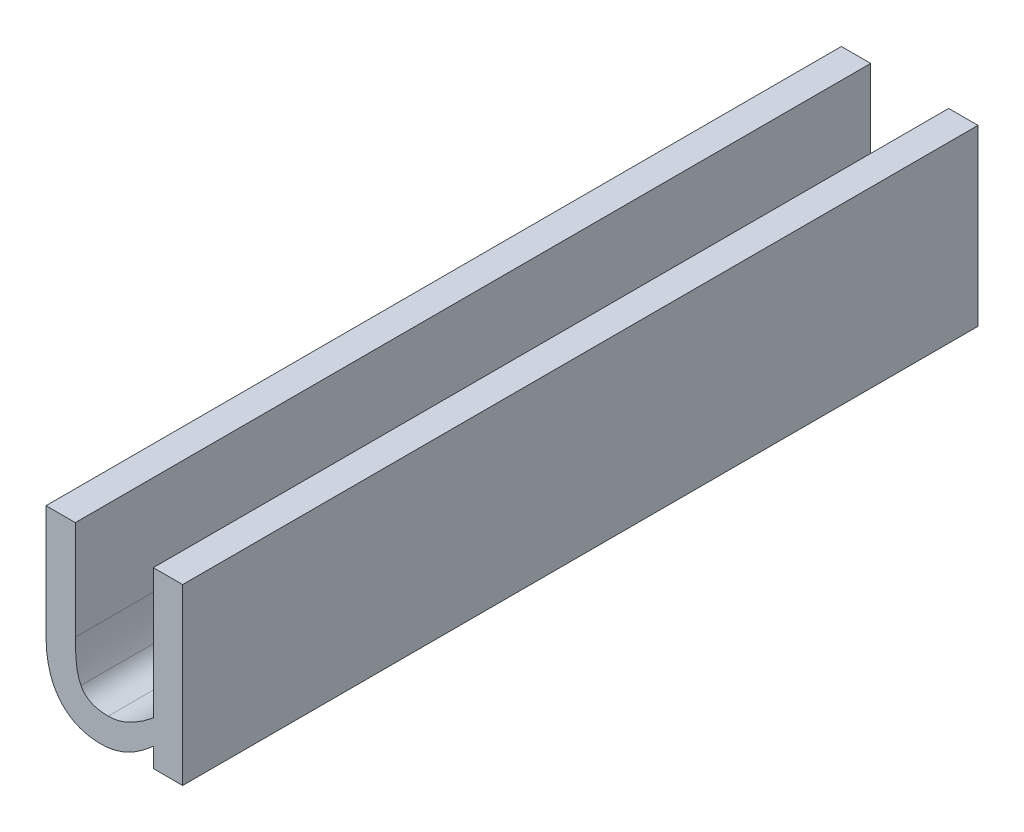
ISO-10303-21;
HEADER;
FILE_DESCRIPTION(('STEP AP214'),'2;1');
FILE_NAME('part.step','',(''),(''),'','','');
FILE_SCHEMA(('AUTOMOTIVE_DESIGN { 1 0 10303 214 1 1 1 1 }'));
ENDSEC;
DATA;
#1=APPLICATION_CONTEXT('core data for automotive mechanical design processes');
#2=APPLICATION_PROTOCOL_DEFINITION('international standard','automotive_design',2000,#1);
#3=PRODUCT_CONTEXT('',#1,'mechanical');
#4=PRODUCT('Part','Part','',(#3));
#5=PRODUCT_RELATED_PRODUCT_CATEGORY('part','',(#4));
#6=PRODUCT_DEFINITION_FORMATION('','',#4);
#7=PRODUCT_DEFINITION_CONTEXT('part definition',#1,'design');
#8=PRODUCT_DEFINITION('design','',#6,#7);
#9=PRODUCT_DEFINITION_SHAPE('','',#8);
#10=(LENGTH_UNIT() NAMED_UNIT(*) SI_UNIT(.MILLI.,.METRE.));
#11=(NAMED_UNIT(*) PLANE_ANGLE_UNIT() SI_UNIT($,.RADIAN.));
#12=(NAMED_UNIT(*) SI_UNIT($,.STERADIAN.) SOLID_ANGLE_UNIT());
#13=UNCERTAINTY_MEASURE_WITH_UNIT(LENGTH_MEASURE(1.E-05),#10,'distance_accuracy_value','');
#14=(GEOMETRIC_REPRESENTATION_CONTEXT(3) GLOBAL_UNCERTAINTY_ASSIGNED_CONTEXT((#13)) GLOBAL_UNIT_ASSIGNED_CONTEXT((#10,
#11,#12)) REPRESENTATION_CONTEXT('',''));
#15=CARTESIAN_POINT('',(0.,0.,0.));
#16=DIRECTION('',(0.,0.,1.));
#17=DIRECTION('',(1.,0.,0.));
#18=AXIS2_PLACEMENT_3D('',#15,#16,#17);
#19=CARTESIAN_POINT('',(5.110634380649,3.57537755009,0.));
#20=DIRECTION('',(0.,1.,0.));
#21=DIRECTION('',(0.,0.,1.));
#22=AXIS2_PLACEMENT_3D('',#19,#20,#21);
#23=PLANE('',#22);
#24=DIRECTION('',(1.,0.,0.));
#25=VECTOR('',#24,1.);
#26=CARTESIAN_POINT('',(5.116094145414,3.57537755009,0.1));
#27=LINE('',#26,#25);
#28=CARTESIAN_POINT('',(5.110634380649,3.57537755009,0.1));
#29=VERTEX_POINT('',#28);
#30=CARTESIAN_POINT('',(5.106948026925,3.57537755009,0.1));
#31=VERTEX_POINT('',#30);
#32=EDGE_CURVE('E290',#29,#31,#27,.F.);
#33=ORIENTED_EDGE('',*,*,#32,.F.);
#34=DIRECTION('',(0.,0.,-1.));
#35=VECTOR('',#34,1.);
#36=CARTESIAN_POINT('',(5.110634380649,3.57537755009,0.));
#37=LINE('',#36,#35);
#38=CARTESIAN_POINT('',(5.110634380649,3.57537755009,0.));
#39=VERTEX_POINT('',#38);
#40=EDGE_CURVE('E284',#39,#29,#37,.F.);
#41=ORIENTED_EDGE('',*,*,#40,.F.);
#42=DIRECTION('',(1.,0.,0.));
#43=VECTOR('',#42,1.);
#44=CARTESIAN_POINT('',(5.116094145414,3.57537755009,0.));
#45=LINE('',#44,#43);
#46=CARTESIAN_POINT('',(5.106948026925,3.57537755009,0.));
#47=VERTEX_POINT('',#46);
#48=EDGE_CURVE('E255',#39,#47,#45,.F.);
#49=ORIENTED_EDGE('',*,*,#48,.T.);
#50=DIRECTION('',(0.,0.,1.));
#51=VECTOR('',#50,1.);
#52=CARTESIAN_POINT('',(5.106948026925,3.57537755009,0.));
#53=LINE('',#52,#51);
#54=EDGE_CURVE('E296',#31,#47,#53,.F.);
#55=ORIENTED_EDGE('',*,*,#54,.F.);
#56=EDGE_LOOP('',(#33,#41,#49,#55));
#57=FACE_BOUND('',#56,.T.);
#58=ADVANCED_FACE('F17',(#57),#23,.T.);
#59=CARTESIAN_POINT('',(5.106948026925,3.57537755009,0.));
#60=DIRECTION('',(-1.,0.,0.));
#61=DIRECTION('',(0.,0.,1.));
#62=AXIS2_PLACEMENT_3D('',#59,#60,#61);
#63=PLANE('',#62);
#64=DIRECTION('',(0.,1.,0.));
#65=VECTOR('',#64,1.);
#66=CARTESIAN_POINT('',(5.106948026925,3.564120544912,0.1));
#67=LINE('',#66,#65);
#68=CARTESIAN_POINT('',(5.106948026925,3.561175636063,0.1));
#69=VERTEX_POINT('',#68);
#70=EDGE_CURVE('E293',#31,#69,#67,.F.);
#71=ORIENTED_EDGE('',*,*,#70,.F.);
#72=ORIENTED_EDGE('',*,*,#54,.T.);
#73=DIRECTION('',(0.,1.,0.));
#74=VECTOR('',#73,1.);
#75=CARTESIAN_POINT('',(5.106948026925,3.564120544912,0.));
#76=LINE('',#75,#74);
#77=CARTESIAN_POINT('',(5.106948026925,3.561175636063,0.));
#78=VERTEX_POINT('',#77);
#79=EDGE_CURVE('E118',#47,#78,#76,.F.);
#80=ORIENTED_EDGE('',*,*,#79,.T.);
#81=DIRECTION('',(0.,0.,-1.));
#82=VECTOR('',#81,1.);
#83=CARTESIAN_POINT('',(5.106948026925,3.561175636063,0.05));
#84=LINE('',#83,#82);
#85=EDGE_CURVE('E128',#69,#78,#84,.T.);
#86=ORIENTED_EDGE('',*,*,#85,.F.);
#87=EDGE_LOOP('',(#71,#72,#80,#86));
#88=FACE_BOUND('',#87,.T.);
#89=ADVANCED_FACE('F371',(#88),#63,.T.);
#90=CARTESIAN_POINT('',(5.106948026925,3.561175636063,0.));
#91=CARTESIAN_POINT('',(5.106948026925,3.561175636063,0.1));
#92=CARTESIAN_POINT('',(5.106948026925,3.557134825249,0.));
#93=CARTESIAN_POINT('',(5.106948026925,3.557134825249,0.1));
#94=CARTESIAN_POINT('',(5.110587119704,3.552881340183,0.));
#95=CARTESIAN_POINT('',(5.110587119704,3.552881340183,0.1));
#96=CARTESIAN_POINT('',(5.113800863976,3.552881340183,0.));
#97=CARTESIAN_POINT('',(5.113800863976,3.552881340183,0.1));
#98=B_SPLINE_SURFACE_WITH_KNOTS('',2,1,((#90,#91),(#92,#93),(#94,#95),(#96,#97)),.UNSPECIFIED.,
.F.,.F.,.F.,(3,1,3),(2,2),(-2.,-1.,0.),(0.,0.01),.UNSPECIFIED.);
#99=CARTESIAN_POINT('',(5.106948026925,3.561175636063,0.1));
#100=CARTESIAN_POINT('',(5.10694928412274,3.56055458030453,0.1));
#101=CARTESIAN_POINT('',(5.10698056456737,3.5599238900148,0.1));
#102=CARTESIAN_POINT('',(5.10715788056713,3.55850561337947,0.1));
#103=CARTESIAN_POINT('',(5.10733258454402,3.5577215766061,0.1));
#104=CARTESIAN_POINT('',(5.10775737660863,3.5566126073752,0.1));
#105=CARTESIAN_POINT('',(5.10792417562004,3.55625666040929,0.1));
#106=CARTESIAN_POINT('',(5.10847730642663,3.55531274969199,0.1));
#107=CARTESIAN_POINT('',(5.10893321565122,3.55476176481283,0.1));
#108=CARTESIAN_POINT('',(5.10973069057193,3.55408984745086,0.1));
#109=CARTESIAN_POINT('',(5.11001123931884,3.55389318340291,0.1));
#110=CARTESIAN_POINT('',(5.11088030395767,3.55339676221615,0.1));
#111=CARTESIAN_POINT('',(5.11151191952059,3.55317203646906,0.1));
#112=CARTESIAN_POINT('',(5.11270324951916,3.55292532100789,0.1));
#113=CARTESIAN_POINT('',(5.11325728490527,3.55287567639697,0.1));
#114=CARTESIAN_POINT('',(5.113800863976,3.552881340183,0.1));
#115=B_SPLINE_CURVE_WITH_KNOTS('',3,(#99,#100,#101,#102,#103,#104,#105,#106,#107,#108,#109,#110,
#111,#112,#113,#114),.UNSPECIFIED.,.F.,.F.,(4,2,2,2,2,2,2,4),(0.,0.00187989626498049,
0.00426669008845683,0.00544185041960019,0.00753867902061455,0.00856165204503632,
0.0105391494342659,0.0121853916034535),.UNSPECIFIED.);
#116=CARTESIAN_POINT('',(5.113800863976,3.552881340183,0.1));
#117=VERTEX_POINT('',#116);
#118=EDGE_CURVE('E191',#69,#117,#115,.T.);
#119=CARTESIAN_POINT('',(5.106948026925,3.561175636063,0.));
#120=CARTESIAN_POINT('',(5.10694928412274,3.56055458030453,0.));
#121=CARTESIAN_POINT('',(5.10698056456737,3.5599238900148,0.));
#122=CARTESIAN_POINT('',(5.10715788056713,3.55850561337947,0.));
#123=CARTESIAN_POINT('',(5.10733258454402,3.5577215766061,0.));
#124=CARTESIAN_POINT('',(5.10775737660863,3.5566126073752,0.));
#125=CARTESIAN_POINT('',(5.10792417562004,3.55625666040929,0.));
#126=CARTESIAN_POINT('',(5.10847730642663,3.55531274969199,0.));
#127=CARTESIAN_POINT('',(5.10893321565122,3.55476176481283,0.));
#128=CARTESIAN_POINT('',(5.10973069057193,3.55408984745086,0.));
#129=CARTESIAN_POINT('',(5.11001123931884,3.55389318340291,0.));
#130=CARTESIAN_POINT('',(5.11088030395767,3.55339676221615,0.));
#131=CARTESIAN_POINT('',(5.11151191952059,3.55317203646906,0.));
#132=CARTESIAN_POINT('',(5.11270324951916,3.55292532100789,0.));
#133=CARTESIAN_POINT('',(5.11325728490527,3.55287567639697,0.));
#134=CARTESIAN_POINT('',(5.113800863976,3.552881340183,0.));
#135=B_SPLINE_CURVE_WITH_KNOTS('',3,(#119,#120,#121,#122,#123,#124,#125,#126,#127,#128,#129,
#130,#131,#132,#133,#134),.UNSPECIFIED.,.F.,.F.,(4,2,2,2,2,2,2,4),(0.,0.00187989626498049,
0.00426669008845683,0.00544185041960019,0.00753867902061455,0.00856165204503632,
0.0105391494342659,0.0121853916034535),.UNSPECIFIED.);
#136=CARTESIAN_POINT('',(5.113800863976,3.552881340183,0.));
#137=VERTEX_POINT('',#136);
#138=EDGE_CURVE('E24',#78,#137,#135,.T.);
#139=DIRECTION('',(0.,0.,-1.));
#140=VECTOR('',#139,1.);
#141=CARTESIAN_POINT('',(5.113800863976,3.552881340183,0.05));
#142=LINE('',#141,#140);
#143=EDGE_CURVE('E126',#117,#137,#142,.T.);
#144=ORIENTED_EDGE('',*,*,#118,.F.);
#145=ORIENTED_EDGE('',*,*,#85,.T.);
#146=ORIENTED_EDGE('',*,*,#138,.T.);
#147=ORIENTED_EDGE('',*,*,#143,.F.);
#148=EDGE_LOOP('',(#144,#145,#146,#147));
#149=FACE_BOUND('',#148,.T.);
#150=ADVANCED_FACE('F125',(#149),#98,.T.);
#151=CARTESIAN_POINT('',(5.113800863976,3.552881340183,0.));
#152=CARTESIAN_POINT('',(5.113800863976,3.552881340183,0.1));
#153=CARTESIAN_POINT('',(5.115596779893,3.552881340183,0.));
#154=CARTESIAN_POINT('',(5.115596779893,3.552881340183,0.1));
#155=CARTESIAN_POINT('',(5.118786893693,3.554440951374,0.));
#156=CARTESIAN_POINT('',(5.118786893693,3.554440951374,0.1));
#157=CARTESIAN_POINT('',(5.120441026774,3.555929671147,0.));
#158=CARTESIAN_POINT('',(5.120441026774,3.555929671147,0.1));
#159=B_SPLINE_SURFACE_WITH_KNOTS('',2,1,((#151,#152),(#153,#154),(#155,#156),(#157,#158)),
.UNSPECIFIED.,.F.,.F.,.F.,(3,1,3),(2,2),(-2.,-1.,0.),(0.,0.01),.UNSPECIFIED.);
#160=CARTESIAN_POINT('',(5.113800863976,3.552881340183,0.1));
#161=CARTESIAN_POINT('',(5.11443410319626,3.55286714268251,0.1));
#162=CARTESIAN_POINT('',(5.11506000163182,3.552948742182,0.1));
#163=CARTESIAN_POINT('',(5.11627481619014,3.55326152794095,0.1));
#164=CARTESIAN_POINT('',(5.11686373031717,3.55349272226516,0.1));
#165=CARTESIAN_POINT('',(5.11798222082593,3.554062692285,0.1));
#166=CARTESIAN_POINT('',(5.11851179525362,3.55440147152194,0.1));
#167=CARTESIAN_POINT('',(5.11951243243862,3.55513425373083,0.1));
#168=CARTESIAN_POINT('',(5.11998461193696,3.55552669798044,0.1));
#169=CARTESIAN_POINT('',(5.120441026774,3.555929671147,0.1));
#170=B_SPLINE_CURVE_WITH_KNOTS('',3,(#160,#161,#162,#163,#164,#165,#166,#167,#168,#169),
.UNSPECIFIED.,.F.,.F.,(4,2,2,2,4),(0.,0.00187989657440125,0.00375989450365513,
0.00563995432227183,0.00747389016123619),.UNSPECIFIED.);
#171=CARTESIAN_POINT('',(5.120441026774,3.555929671147,0.1));
#172=VERTEX_POINT('',#171);
#173=EDGE_CURVE('E136',#117,#172,#170,.T.);
#174=CARTESIAN_POINT('',(5.113800863976,3.552881340183,0.));
#175=CARTESIAN_POINT('',(5.11443410319626,3.55286714268251,0.));
#176=CARTESIAN_POINT('',(5.11506000163182,3.552948742182,0.));
#177=CARTESIAN_POINT('',(5.11627481619014,3.55326152794095,0.));
#178=CARTESIAN_POINT('',(5.11686373031717,3.55349272226516,0.));
#179=CARTESIAN_POINT('',(5.11798222082593,3.554062692285,0.));
#180=CARTESIAN_POINT('',(5.11851179525362,3.55440147152194,0.));
#181=CARTESIAN_POINT('',(5.11951243243862,3.55513425373083,0.));
#182=CARTESIAN_POINT('',(5.11998461193696,3.55552669798044,0.));
#183=CARTESIAN_POINT('',(5.120441026774,3.555929671147,0.));
#184=B_SPLINE_CURVE_WITH_KNOTS('',3,(#174,#175,#176,#177,#178,#179,#180,#181,#182,#183),
.UNSPECIFIED.,.F.,.F.,(4,2,2,2,4),(0.,0.00187989657440125,0.00375989450365513,
0.00563995432227183,0.00747389016123619),.UNSPECIFIED.);
#185=CARTESIAN_POINT('',(5.120441026774,3.555929671147,0.));
#186=VERTEX_POINT('',#185);
#187=EDGE_CURVE('E131',#137,#186,#184,.T.);
#188=DIRECTION('',(0.,0.,1.));
#189=VECTOR('',#188,1.);
#190=CARTESIAN_POINT('',(5.120441026774,3.555929671147,0.));
#191=LINE('',#190,#189);
#192=EDGE_CURVE('E299',#172,#186,#191,.F.);
#193=ORIENTED_EDGE('',*,*,#173,.F.);
#194=ORIENTED_EDGE('',*,*,#143,.T.);
#195=ORIENTED_EDGE('',*,*,#187,.T.);
#196=ORIENTED_EDGE('',*,*,#192,.F.);
#197=EDGE_LOOP('',(#193,#194,#195,#196));
#198=FACE_BOUND('',#197,.T.);
#199=ADVANCED_FACE('F133',(#198),#159,.T.);
#200=CARTESIAN_POINT('',(5.120441026774,3.57537755009,0.));
#201=DIRECTION('',(-1.,0.,0.));
#202=DIRECTION('',(0.,0.,1.));
#203=AXIS2_PLACEMENT_3D('',#200,#201,#202);
#204=PLANE('',#203);
#205=DIRECTION('',(0.,1.,0.));
#206=VECTOR('',#205,1.);
#207=CARTESIAN_POINT('',(5.120441026774,3.564120544912,0.1));
#208=LINE('',#207,#206);
#209=CARTESIAN_POINT('',(5.120441026774,3.57537755009,0.1));
#210=VERTEX_POINT('',#209);
#211=CARTESIAN_POINT('',(5.120441026774,3.559025263057,0.1));
#212=VERTEX_POINT('',#211);
#213=EDGE_CURVE('E318',#210,#212,#208,.F.);
#214=ORIENTED_EDGE('',*,*,#213,.F.);
#215=DIRECTION('',(0.,0.,1.));
#216=VECTOR('',#215,1.);
#217=CARTESIAN_POINT('',(5.120441026774,3.57537755009,0.));
#218=LINE('',#217,#216);
#219=CARTESIAN_POINT('',(5.120441026774,3.57537755009,0.));
#220=VERTEX_POINT('',#219);
#221=EDGE_CURVE('E281',#220,#210,#218,.T.);
#222=ORIENTED_EDGE('',*,*,#221,.F.);
#223=DIRECTION('',(0.,1.,0.));
#224=VECTOR('',#223,1.);
#225=CARTESIAN_POINT('',(5.120441026774,3.564120544912,0.));
#226=LINE('',#225,#224);
#227=CARTESIAN_POINT('',(5.120441026774,3.559025263057,0.));
#228=VERTEX_POINT('',#227);
#229=EDGE_CURVE('E145',#220,#228,#226,.F.);
#230=ORIENTED_EDGE('',*,*,#229,.T.);
#231=DIRECTION('',(0.,0.,-1.));
#232=VECTOR('',#231,1.);
#233=CARTESIAN_POINT('',(5.120441026774,3.559025263057,0.05));
#234=LINE('',#233,#232);
#235=EDGE_CURVE('E138',#212,#228,#234,.T.);
#236=ORIENTED_EDGE('',*,*,#235,.F.);
#237=EDGE_LOOP('',(#214,#222,#230,#236));
#238=FACE_BOUND('',#237,.T.);
#239=ADVANCED_FACE('F167',(#238),#204,.T.);
#240=CARTESIAN_POINT('',(5.120441026774,3.559025263057,0.));
#241=CARTESIAN_POINT('',(5.120441026774,3.559025263057,0.1));
#242=CARTESIAN_POINT('',(5.119046828892,3.557843739427,0.));
#243=CARTESIAN_POINT('',(5.119046828892,3.557843739427,0.1));
#244=CARTESIAN_POINT('',(5.116140280763,3.556378650126,0.));
#245=CARTESIAN_POINT('',(5.116140280763,3.556378650126,0.1));
#246=CARTESIAN_POINT('',(5.114769713353,3.556378650126,0.));
#247=CARTESIAN_POINT('',(5.114769713353,3.556378650126,0.1));
#248=B_SPLINE_SURFACE_WITH_KNOTS('',2,1,((#240,#241),(#242,#243),(#244,#245),(#246,#247)),
.UNSPECIFIED.,.F.,.F.,.F.,(3,1,3),(2,2),(-2.,-1.,0.),(0.,0.01),.UNSPECIFIED.);
#249=CARTESIAN_POINT('',(5.120441026774,3.559025263057,0.1));
#250=CARTESIAN_POINT('',(5.12009076530873,3.55872772923503,0.1));
#251=CARTESIAN_POINT('',(5.11972866368542,3.55844482418824,0.1));
#252=CARTESIAN_POINT('',(5.11898059270005,3.55791340611223,0.1));
#253=CARTESIAN_POINT('',(5.11859464411903,3.55766486373314,0.1));
#254=CARTESIAN_POINT('',(5.11779732977575,3.55720633915984,0.1));
#255=CARTESIAN_POINT('',(5.11738591681659,3.55699643161811,0.1));
#256=CARTESIAN_POINT('',(5.1162700983815,3.55654752174492,0.1));
#257=CARTESIAN_POINT('',(5.11554252597456,3.55637153188184,0.1));
#258=CARTESIAN_POINT('',(5.114769713353,3.556378650126,0.1));
#259=B_SPLINE_CURVE_WITH_KNOTS('',3,(#249,#250,#251,#252,#253,#254,#255,#256,#257,#258),
.UNSPECIFIED.,.F.,.F.,(4,2,2,2,4),(0.,0.00137723306281847,0.00275328243787176,
0.00413196340459007,0.00636758689212963),.UNSPECIFIED.);
#260=CARTESIAN_POINT('',(5.114769713353,3.556378650126,0.1));
#261=VERTEX_POINT('',#260);
#262=EDGE_CURVE('E192',#212,#261,#259,.T.);
#263=CARTESIAN_POINT('',(5.120441026774,3.559025263057,0.));
#264=CARTESIAN_POINT('',(5.12009076530873,3.55872772923503,0.));
#265=CARTESIAN_POINT('',(5.11972866368542,3.55844482418824,0.));
#266=CARTESIAN_POINT('',(5.11898059270005,3.55791340611223,0.));
#267=CARTESIAN_POINT('',(5.11859464411903,3.55766486373314,0.));
#268=CARTESIAN_POINT('',(5.11779732977575,3.55720633915984,0.));
#269=CARTESIAN_POINT('',(5.11738591681659,3.55699643161811,0.));
#270=CARTESIAN_POINT('',(5.1162700983815,3.55654752174492,0.));
#271=CARTESIAN_POINT('',(5.11554252597456,3.55637153188184,0.));
#272=CARTESIAN_POINT('',(5.114769713353,3.556378650126,0.));
#273=B_SPLINE_CURVE_WITH_KNOTS('',3,(#263,#264,#265,#266,#267,#268,#269,#270,#271,#272),
.UNSPECIFIED.,.F.,.F.,(4,2,2,2,4),(0.,0.00137723306281847,0.00275328243787176,
0.00413196340459007,0.00636758689212963),.UNSPECIFIED.);
#274=CARTESIAN_POINT('',(5.114769713353,3.556378650126,0.));
#275=VERTEX_POINT('',#274);
#276=EDGE_CURVE('E153',#228,#275,#273,.T.);
#277=DIRECTION('',(0.,0.,-1.));
#278=VECTOR('',#277,1.);
#279=CARTESIAN_POINT('',(5.114769713353,3.556378650126,0.05));
#280=LINE('',#279,#278);
#281=EDGE_CURVE('E325',#261,#275,#280,.T.);
#282=ORIENTED_EDGE('',*,*,#262,.F.);
#283=ORIENTED_EDGE('',*,*,#235,.T.);
#284=ORIENTED_EDGE('',*,*,#276,.T.);
#285=ORIENTED_EDGE('',*,*,#281,.F.);
#286=EDGE_LOOP('',(#282,#283,#284,#285));
#287=FACE_BOUND('',#286,.T.);
#288=ADVANCED_FACE('F172',(#287),#248,.T.);
#289=CARTESIAN_POINT('',(5.114769713353,3.556378650126,0.));
#290=CARTESIAN_POINT('',(5.114769713353,3.556378650126,0.1));
#291=CARTESIAN_POINT('',(5.113399145942,3.556378650126,0.));
#292=CARTESIAN_POINT('',(5.113399145942,3.556378650126,0.1));
#293=CARTESIAN_POINT('',(5.111792273806,3.557182086195,0.));
#294=CARTESIAN_POINT('',(5.111792273806,3.557182086195,0.1));
#295=CARTESIAN_POINT('',(5.111343294827,3.558009152735,0.));
#296=CARTESIAN_POINT('',(5.111343294827,3.558009152735,0.1));
#297=B_SPLINE_SURFACE_WITH_KNOTS('',2,1,((#289,#290),(#291,#292),(#293,#294),(#295,#296)),
.UNSPECIFIED.,.F.,.F.,.F.,(3,1,3),(2,2),(-2.,-1.,0.),(0.,0.01),.UNSPECIFIED.);
#298=CARTESIAN_POINT('',(5.114769713353,3.556378650126,0.1));
#299=CARTESIAN_POINT('',(5.11431916177213,3.55636709332846,0.1));
#300=CARTESIAN_POINT('',(5.11384097837579,3.55640332720968,0.1));
#301=CARTESIAN_POINT('',(5.11303404059369,3.55659311451463,0.1));
#302=CARTESIAN_POINT('',(5.11269681757504,3.55671667754377,0.1));
#303=CARTESIAN_POINT('',(5.1119530061505,3.55714566300201,0.1));
#304=CARTESIAN_POINT('',(5.11158206677246,3.55750746239181,0.1));
#305=CARTESIAN_POINT('',(5.111343294827,3.558009152735,0.1));
#306=B_SPLINE_CURVE_WITH_KNOTS('',3,(#298,#299,#300,#301,#302,#303,#304,#305),.UNSPECIFIED.,.F.,
.F.,(4,2,2,4),(0.,0.00139303844021079,0.00245436902079411,0.00398678487807781),.UNSPECIFIED.);
#307=CARTESIAN_POINT('',(5.111343294827,3.558009152735,0.1));
#308=VERTEX_POINT('',#307);
#309=EDGE_CURVE('E221',#261,#308,#306,.T.);
#310=CARTESIAN_POINT('',(5.114769713353,3.556378650126,0.));
#311=CARTESIAN_POINT('',(5.11431916177213,3.55636709332846,0.));
#312=CARTESIAN_POINT('',(5.11384097837579,3.55640332720968,0.));
#313=CARTESIAN_POINT('',(5.11303404059369,3.55659311451463,0.));
#314=CARTESIAN_POINT('',(5.11269681757504,3.55671667754377,0.));
#315=CARTESIAN_POINT('',(5.1119530061505,3.55714566300202,0.));
#316=CARTESIAN_POINT('',(5.11158206677246,3.55750746239181,0.));
#317=CARTESIAN_POINT('',(5.111343294827,3.558009152735,0.));
#318=B_SPLINE_CURVE_WITH_KNOTS('',3,(#310,#311,#312,#313,#314,#315,#316,#317),.UNSPECIFIED.,.F.,
.F.,(4,2,2,4),(0.,0.00139303844021079,0.00245436902079442,0.00398678487807749),.UNSPECIFIED.);
#319=CARTESIAN_POINT('',(5.111343294827,3.558009152735,0.));
#320=VERTEX_POINT('',#319);
#321=EDGE_CURVE('E239',#275,#320,#318,.T.);
#322=DIRECTION('',(0.,0.,-1.));
#323=VECTOR('',#322,1.);
#324=CARTESIAN_POINT('',(5.111343294827,3.558009152735,0.05));
#325=LINE('',#324,#323);
#326=EDGE_CURVE('E287',#308,#320,#325,.T.);
#327=ORIENTED_EDGE('',*,*,#309,.F.);
#328=ORIENTED_EDGE('',*,*,#281,.T.);
#329=ORIENTED_EDGE('',*,*,#321,.T.);
#330=ORIENTED_EDGE('',*,*,#326,.F.);
#331=EDGE_LOOP('',(#327,#328,#329,#330));
#332=FACE_BOUND('',#331,.T.);
#333=ADVANCED_FACE('F227',(#332),#297,.T.);
#334=CARTESIAN_POINT('',(5.111343294827,3.558009152735,0.));
#335=CARTESIAN_POINT('',(5.111343294827,3.558009152735,0.1));
#336=CARTESIAN_POINT('',(5.11091794632,3.558788958331,0.));
#337=CARTESIAN_POINT('',(5.11091794632,3.558788958331,0.1));
#338=CARTESIAN_POINT('',(5.110634380649,3.561388310316,0.));
#339=CARTESIAN_POINT('',(5.110634380649,3.561388310316,0.1));
#340=CARTESIAN_POINT('',(5.110634380649,3.562900660562,0.));
#341=CARTESIAN_POINT('',(5.110634380649,3.562900660562,0.1));
#342=B_SPLINE_SURFACE_WITH_KNOTS('',2,1,((#334,#335),(#336,#337),(#338,#339),(#340,#341)),
.UNSPECIFIED.,.F.,.F.,.F.,(3,1,3),(2,2),(-2.,-1.,0.),(0.,0.01),.UNSPECIFIED.);
#343=CARTESIAN_POINT('',(5.111343294827,3.558009152735,0.1));
#344=CARTESIAN_POINT('',(5.11115547890601,3.55836759858938,0.1));
#345=CARTESIAN_POINT('',(5.11102696268499,3.55874331963093,0.1));
#346=CARTESIAN_POINT('',(5.1108144570365,3.55964116542935,0.1));
#347=CARTESIAN_POINT('',(5.11075923318055,3.56017062736919,0.1));
#348=CARTESIAN_POINT('',(5.11068772280115,3.56109465479001,0.1));
#349=CARTESIAN_POINT('',(5.11066515178001,3.56148983401021,0.1));
#350=CARTESIAN_POINT('',(5.11063920111818,3.56222329852086,0.1));
#351=CARTESIAN_POINT('',(5.11063350443018,3.56256148414393,0.1));
#352=CARTESIAN_POINT('',(5.110634380649,3.562900660562,0.1));
#353=B_SPLINE_CURVE_WITH_KNOTS('',3,(#343,#344,#345,#346,#347,#348,#349,#350,#351,#352),
.UNSPECIFIED.,.F.,.F.,(4,2,2,2,4),(0.,0.00119127993647332,0.00277638467864263,
0.00396498135718239,0.00498039838134371),.UNSPECIFIED.);
#354=CARTESIAN_POINT('',(5.110634380649,3.562900660562,0.1));
#355=VERTEX_POINT('',#354);
#356=EDGE_CURVE('E215',#308,#355,#353,.T.);
#357=CARTESIAN_POINT('',(5.111343294827,3.558009152735,0.));
#358=CARTESIAN_POINT('',(5.11115547890601,3.55836759858938,0.));
#359=CARTESIAN_POINT('',(5.11102696268499,3.55874331963093,0.));
#360=CARTESIAN_POINT('',(5.1108144570365,3.55964116542935,0.));
#361=CARTESIAN_POINT('',(5.11075923318055,3.56017062736919,0.));
#362=CARTESIAN_POINT('',(5.11068772280115,3.56109465479001,0.));
#363=CARTESIAN_POINT('',(5.11066515178001,3.56148983401021,0.));
#364=CARTESIAN_POINT('',(5.11063920111818,3.56222329852086,0.));
#365=CARTESIAN_POINT('',(5.11063350443018,3.56256148414393,0.));
#366=CARTESIAN_POINT('',(5.110634380649,3.562900660562,0.));
#367=B_SPLINE_CURVE_WITH_KNOTS('',3,(#357,#358,#359,#360,#361,#362,#363,#364,#365,#366),
.UNSPECIFIED.,.F.,.F.,(4,2,2,2,4),(0.,0.00119127993647332,0.00277638467864263,
0.00396498135718239,0.00498039838134371),.UNSPECIFIED.);
#368=CARTESIAN_POINT('',(5.110634380649,3.562900660562,0.));
#369=VERTEX_POINT('',#368);
#370=EDGE_CURVE('E244',#320,#369,#367,.T.);
#371=DIRECTION('',(0.,0.,-1.));
#372=VECTOR('',#371,1.);
#373=CARTESIAN_POINT('',(5.110634380649,3.562900660562,0.));
#374=LINE('',#373,#372);
#375=EDGE_CURVE('E286',#355,#369,#374,.T.);
#376=ORIENTED_EDGE('',*,*,#356,.F.);
#377=ORIENTED_EDGE('',*,*,#326,.T.);
#378=ORIENTED_EDGE('',*,*,#370,.T.);
#379=ORIENTED_EDGE('',*,*,#375,.F.);
#380=EDGE_LOOP('',(#376,#377,#378,#379));
#381=FACE_BOUND('',#380,.T.);
#382=ADVANCED_FACE('F19',(#381),#342,.T.);
#383=CARTESIAN_POINT('',(5.110634380649,3.562900660562,0.));
#384=DIRECTION('',(1.,0.,0.));
#385=DIRECTION('',(0.,0.,-1.));
#386=AXIS2_PLACEMENT_3D('',#383,#384,#385);
#387=PLANE('',#386);
#388=DIRECTION('',(0.,1.,0.));
#389=VECTOR('',#388,1.);
#390=CARTESIAN_POINT('',(5.110634380649,3.564120544912,0.1));
#391=LINE('',#390,#389);
#392=EDGE_CURVE('E331',#355,#29,#391,.T.);
#393=ORIENTED_EDGE('',*,*,#392,.F.);
#394=ORIENTED_EDGE('',*,*,#375,.T.);
#395=DIRECTION('',(0.,1.,0.));
#396=VECTOR('',#395,1.);
#397=CARTESIAN_POINT('',(5.110634380649,3.564120544912,0.));
#398=LINE('',#397,#396);
#399=EDGE_CURVE('E249',#369,#39,#398,.T.);
#400=ORIENTED_EDGE('',*,*,#399,.T.);
#401=ORIENTED_EDGE('',*,*,#40,.T.);
#402=EDGE_LOOP('',(#393,#394,#400,#401));
#403=FACE_BOUND('',#402,.T.);
#404=ADVANCED_FACE('F368',(#403),#387,.T.);
#405=CARTESIAN_POINT('',(5.120441026774,3.555929671147,0.));
#406=DIRECTION('',(-1.,0.,0.));
#407=DIRECTION('',(0.,0.,1.));
#408=AXIS2_PLACEMENT_3D('',#405,#406,#407);
#409=PLANE('',#408);
#410=DIRECTION('',(0.,1.,0.));
#411=VECTOR('',#410,1.);
#412=CARTESIAN_POINT('',(5.120441026774,3.564120544912,0.1));
#413=LINE('',#412,#411);
#414=CARTESIAN_POINT('',(5.120441026774,3.55349573247,0.1));
#415=VERTEX_POINT('',#414);
#416=EDGE_CURVE('E190',#172,#415,#413,.F.);
#417=ORIENTED_EDGE('',*,*,#416,.F.);
#418=ORIENTED_EDGE('',*,*,#192,.T.);
#419=DIRECTION('',(0.,1.,0.));
#420=VECTOR('',#419,1.);
#421=CARTESIAN_POINT('',(5.120441026774,3.564120544912,0.));
#422=LINE('',#421,#420);
#423=CARTESIAN_POINT('',(5.120441026774,3.55349573247,0.));
#424=VERTEX_POINT('',#423);
#425=EDGE_CURVE('E144',#186,#424,#422,.F.);
#426=ORIENTED_EDGE('',*,*,#425,.T.);
#427=DIRECTION('',(0.,0.,-1.));
#428=VECTOR('',#427,1.);
#429=CARTESIAN_POINT('',(5.120441026774,3.55349573247,0.));
#430=LINE('',#429,#428);
#431=EDGE_CURVE('E273',#415,#424,#430,.T.);
#432=ORIENTED_EDGE('',*,*,#431,.F.);
#433=EDGE_LOOP('',(#417,#418,#426,#432));
#434=FACE_BOUND('',#433,.T.);
#435=ADVANCED_FACE('F351',(#434),#409,.T.);
#436=CARTESIAN_POINT('',(5.116094145414,3.564120544912,0.));
#437=DIRECTION('',(0.,0.,1.));
#438=DIRECTION('',(1.,0.,0.));
#439=AXIS2_PLACEMENT_3D('',#436,#437,#438);
#440=PLANE('',#439);
#441=ORIENTED_EDGE('',*,*,#399,.F.);
#442=ORIENTED_EDGE('',*,*,#370,.F.);
#443=ORIENTED_EDGE('',*,*,#321,.F.);
#444=ORIENTED_EDGE('',*,*,#276,.F.);
#445=ORIENTED_EDGE('',*,*,#229,.F.);
#446=DIRECTION('',(1.,0.,0.));
#447=VECTOR('',#446,1.);
#448=CARTESIAN_POINT('',(5.124127380499,3.57537755009,0.));
#449=LINE('',#448,#447);
#450=CARTESIAN_POINT('',(5.124127380499,3.57537755009,0.));
#451=VERTEX_POINT('',#450);
#452=EDGE_CURVE('E261',#451,#220,#449,.F.);
#453=ORIENTED_EDGE('',*,*,#452,.F.);
#454=DIRECTION('',(0.,1.,0.));
#455=VECTOR('',#454,1.);
#456=CARTESIAN_POINT('',(5.124127380499,3.55349573247,0.));
#457=LINE('',#456,#455);
#458=CARTESIAN_POINT('',(5.124127380499,3.55349573247,0.));
#459=VERTEX_POINT('',#458);
#460=EDGE_CURVE('E269',#459,#451,#457,.T.);
#461=ORIENTED_EDGE('',*,*,#460,.F.);
#462=DIRECTION('',(1.,0.,0.));
#463=VECTOR('',#462,1.);
#464=CARTESIAN_POINT('',(5.120441026774,3.55349573247,0.));
#465=LINE('',#464,#463);
#466=EDGE_CURVE('E334',#424,#459,#465,.T.);
#467=ORIENTED_EDGE('',*,*,#466,.F.);
#468=ORIENTED_EDGE('',*,*,#425,.F.);
#469=ORIENTED_EDGE('',*,*,#187,.F.);
#470=ORIENTED_EDGE('',*,*,#138,.F.);
#471=ORIENTED_EDGE('',*,*,#79,.F.);
#472=ORIENTED_EDGE('',*,*,#48,.F.);
#473=EDGE_LOOP('',(#441,#442,#443,#444,#445,#453,#461,#467,#468,#469,#470,#471,#472));
#474=FACE_BOUND('',#473,.T.);
#475=ADVANCED_FACE('F142',(#474),#440,.F.);
#476=CARTESIAN_POINT('',(5.124127380499,3.57537755009,0.));
#477=DIRECTION('',(0.,1.,0.));
#478=DIRECTION('',(0.,0.,1.));
#479=AXIS2_PLACEMENT_3D('',#476,#477,#478);
#480=PLANE('',#479);
#481=DIRECTION('',(1.,0.,0.));
#482=VECTOR('',#481,1.);
#483=CARTESIAN_POINT('',(5.116094145414,3.57537755009,0.1));
#484=LINE('',#483,#482);
#485=CARTESIAN_POINT('',(5.124127380499,3.57537755009,0.1));
#486=VERTEX_POINT('',#485);
#487=EDGE_CURVE('E301',#486,#210,#484,.F.);
#488=ORIENTED_EDGE('',*,*,#487,.F.);
#489=DIRECTION('',(0.,0.,-1.));
#490=VECTOR('',#489,1.);
#491=CARTESIAN_POINT('',(5.124127380499,3.57537755009,0.));
#492=LINE('',#491,#490);
#493=EDGE_CURVE('E272',#451,#486,#492,.F.);
#494=ORIENTED_EDGE('',*,*,#493,.F.);
#495=ORIENTED_EDGE('',*,*,#452,.T.);
#496=ORIENTED_EDGE('',*,*,#221,.T.);
#497=EDGE_LOOP('',(#488,#494,#495,#496));
#498=FACE_BOUND('',#497,.T.);
#499=ADVANCED_FACE('F208',(#498),#480,.T.);
#500=CARTESIAN_POINT('',(5.116094145414,3.564120544912,0.1));
#501=DIRECTION('',(0.,0.,1.));
#502=DIRECTION('',(1.,0.,0.));
#503=AXIS2_PLACEMENT_3D('',#500,#501,#502);
#504=PLANE('',#503);
#505=ORIENTED_EDGE('',*,*,#356,.T.);
#506=ORIENTED_EDGE('',*,*,#392,.T.);
#507=ORIENTED_EDGE('',*,*,#32,.T.);
#508=ORIENTED_EDGE('',*,*,#70,.T.);
#509=ORIENTED_EDGE('',*,*,#118,.T.);
#510=ORIENTED_EDGE('',*,*,#173,.T.);
#511=ORIENTED_EDGE('',*,*,#416,.T.);
#512=DIRECTION('',(1.,0.,0.));
#513=VECTOR('',#512,1.);
#514=CARTESIAN_POINT('',(5.120441026774,3.55349573247,0.1));
#515=LINE('',#514,#513);
#516=CARTESIAN_POINT('',(5.124127380499,3.55349573247,0.1));
#517=VERTEX_POINT('',#516);
#518=EDGE_CURVE('E45',#517,#415,#515,.F.);
#519=ORIENTED_EDGE('',*,*,#518,.F.);
#520=DIRECTION('',(0.,1.,0.));
#521=VECTOR('',#520,1.);
#522=CARTESIAN_POINT('',(5.124127380499,3.55349573247,0.1));
#523=LINE('',#522,#521);
#524=EDGE_CURVE('E36',#486,#517,#523,.F.);
#525=ORIENTED_EDGE('',*,*,#524,.F.);
#526=ORIENTED_EDGE('',*,*,#487,.T.);
#527=ORIENTED_EDGE('',*,*,#213,.T.);
#528=ORIENTED_EDGE('',*,*,#262,.T.);
#529=ORIENTED_EDGE('',*,*,#309,.T.);
#530=EDGE_LOOP('',(#505,#506,#507,#508,#509,#510,#511,#519,#525,#526,#527,#528,#529));
#531=FACE_BOUND('',#530,.T.);
#532=ADVANCED_FACE('F203',(#531),#504,.T.);
#533=CARTESIAN_POINT('',(5.120441026774,3.55349573247,0.));
#534=DIRECTION('',(0.,-1.,0.));
#535=DIRECTION('',(0.,0.,-1.));
#536=AXIS2_PLACEMENT_3D('',#533,#534,#535);
#537=PLANE('',#536);
#538=ORIENTED_EDGE('',*,*,#518,.T.);
#539=ORIENTED_EDGE('',*,*,#431,.T.);
#540=ORIENTED_EDGE('',*,*,#466,.T.);
#541=DIRECTION('',(0.,0.,-1.));
#542=VECTOR('',#541,1.);
#543=CARTESIAN_POINT('',(5.124127380499,3.55349573247,0.));
#544=LINE('',#543,#542);
#545=EDGE_CURVE('E11',#517,#459,#544,.T.);
#546=ORIENTED_EDGE('',*,*,#545,.F.);
#547=EDGE_LOOP('',(#538,#539,#540,#546));
#548=FACE_BOUND('',#547,.T.);
#549=ADVANCED_FACE('F207',(#548),#537,.T.);
#550=CARTESIAN_POINT('',(5.124127380499,3.55349573247,0.));
#551=DIRECTION('',(1.,0.,0.));
#552=DIRECTION('',(0.,0.,-1.));
#553=AXIS2_PLACEMENT_3D('',#550,#551,#552);
#554=PLANE('',#553);
#555=ORIENTED_EDGE('',*,*,#524,.T.);
#556=ORIENTED_EDGE('',*,*,#545,.T.);
#557=ORIENTED_EDGE('',*,*,#460,.T.);
#558=ORIENTED_EDGE('',*,*,#493,.T.);
#559=EDGE_LOOP('',(#555,#556,#557,#558));
#560=FACE_BOUND('',#559,.T.);
#561=ADVANCED_FACE('F354',(#560),#554,.T.);
#562=CLOSED_SHELL('',(#58,#89,#150,#199,#239,#288,#333,#382,#404,#435,#475,#499,#532,#549,#561));
#563=MANIFOLD_SOLID_BREP('B1',#562);
#564=ADVANCED_BREP_SHAPE_REPRESENTATION('',(#18,#563),#14);
#565=SHAPE_DEFINITION_REPRESENTATION(#9,#564);
ENDSEC;
END-ISO-10303-21;
